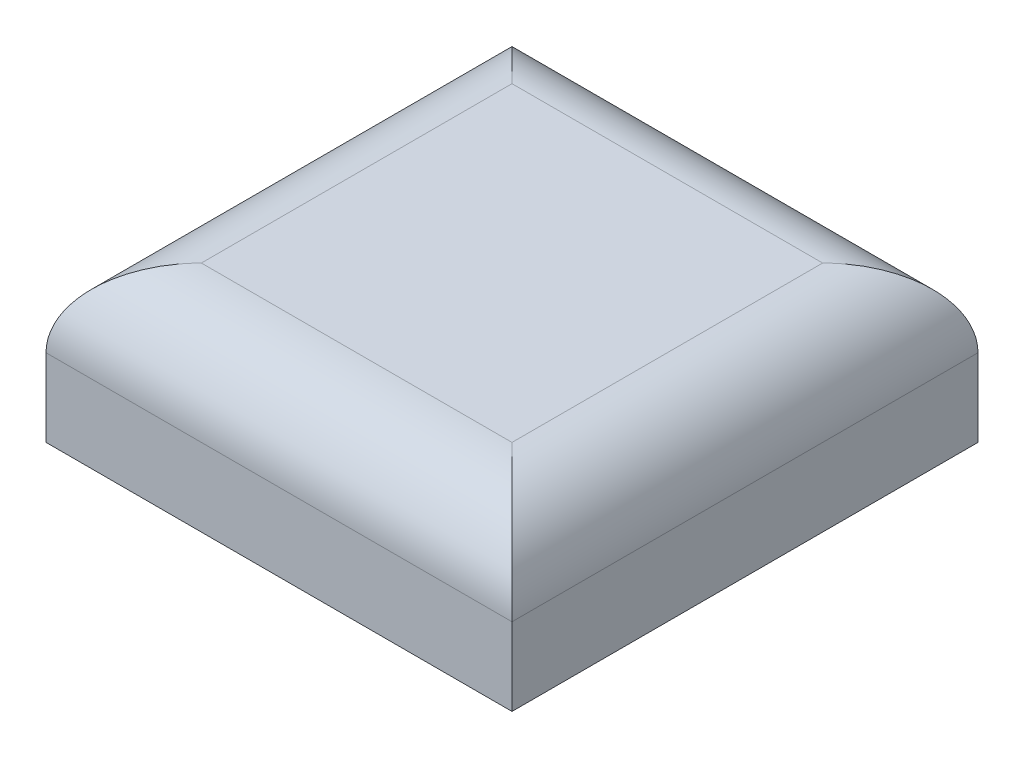
ISO-10303-21;
HEADER;
FILE_DESCRIPTION(('STEP AP214'),'2;1');
FILE_NAME('part.step','',(''),(''),'','','');
FILE_SCHEMA(('AUTOMOTIVE_DESIGN { 1 0 10303 214 1 1 1 1 }'));
ENDSEC;
DATA;
#1=APPLICATION_CONTEXT('core data for automotive mechanical design processes');
#2=APPLICATION_PROTOCOL_DEFINITION('international standard','automotive_design',2000,#1);
#3=PRODUCT_CONTEXT('',#1,'mechanical');
#4=PRODUCT('Part','Part','',(#3));
#5=PRODUCT_RELATED_PRODUCT_CATEGORY('part','',(#4));
#6=PRODUCT_DEFINITION_FORMATION('','',#4);
#7=PRODUCT_DEFINITION_CONTEXT('part definition',#1,'design');
#8=PRODUCT_DEFINITION('design','',#6,#7);
#9=PRODUCT_DEFINITION_SHAPE('','',#8);
#10=(LENGTH_UNIT() NAMED_UNIT(*) SI_UNIT(.MILLI.,.METRE.));
#11=(NAMED_UNIT(*) PLANE_ANGLE_UNIT() SI_UNIT($,.RADIAN.));
#12=(NAMED_UNIT(*) SI_UNIT($,.STERADIAN.) SOLID_ANGLE_UNIT());
#13=UNCERTAINTY_MEASURE_WITH_UNIT(LENGTH_MEASURE(1.E-05),#10,'distance_accuracy_value','');
#14=(GEOMETRIC_REPRESENTATION_CONTEXT(3) GLOBAL_UNCERTAINTY_ASSIGNED_CONTEXT((#13)) GLOBAL_UNIT_ASSIGNED_CONTEXT((#10,
#11,#12)) REPRESENTATION_CONTEXT('',''));
#15=CARTESIAN_POINT('',(0.,0.,0.));
#16=DIRECTION('',(0.,0.,1.));
#17=DIRECTION('',(1.,0.,0.));
#18=AXIS2_PLACEMENT_3D('',#15,#16,#17);
#19=CARTESIAN_POINT('',(-3.02307692307692,4.,-8.33076923076923));
#20=DIRECTION('',(-1.,0.,0.));
#21=DIRECTION('',(0.,0.,1.));
#22=AXIS2_PLACEMENT_3D('',#19,#20,#21);
#23=PLANE('',#22);
#24=DIRECTION('',(0.,-1.,0.));
#25=VECTOR('',#24,1.);
#26=CARTESIAN_POINT('',(-3.02307692307692,4.,-8.33076923076923));
#27=LINE('',#26,#25);
#28=CARTESIAN_POINT('',(-3.02307692307692,2.,-8.33076923076923));
#29=VERTEX_POINT('',#28);
#30=CARTESIAN_POINT('',(-3.02307692307692,0.,-8.33076923076923));
#31=VERTEX_POINT('',#30);
#32=EDGE_CURVE('E94',#29,#31,#27,.T.);
#33=ORIENTED_EDGE('',*,*,#32,.F.);
#34=DIRECTION('',(0.,0.,-1.));
#35=VECTOR('',#34,1.);
#36=CARTESIAN_POINT('',(-3.02307692307692,2.,3.66923076923077));
#37=LINE('',#36,#35);
#38=CARTESIAN_POINT('',(-3.02307692307692,2.,3.66923076923077));
#39=VERTEX_POINT('',#38);
#40=EDGE_CURVE('E64',#29,#39,#37,.F.);
#41=ORIENTED_EDGE('',*,*,#40,.T.);
#42=DIRECTION('',(0.,-1.,0.));
#43=VECTOR('',#42,1.);
#44=CARTESIAN_POINT('',(-3.02307692307692,4.,3.66923076923077));
#45=LINE('',#44,#43);
#46=CARTESIAN_POINT('',(-3.02307692307692,0.,3.66923076923077));
#47=VERTEX_POINT('',#46);
#48=EDGE_CURVE('E116',#39,#47,#45,.T.);
#49=ORIENTED_EDGE('',*,*,#48,.T.);
#50=DIRECTION('',(0.,0.,-1.));
#51=VECTOR('',#50,1.);
#52=CARTESIAN_POINT('',(-3.02307692307692,0.,-8.33076923076923));
#53=LINE('',#52,#51);
#54=EDGE_CURVE('E111',#47,#31,#53,.T.);
#55=ORIENTED_EDGE('',*,*,#54,.T.);
#56=EDGE_LOOP('',(#33,#41,#49,#55));
#57=FACE_BOUND('',#56,.T.);
#58=ADVANCED_FACE('F39',(#57),#23,.F.);
#59=CARTESIAN_POINT('',(-15.0230769230769,4.,-8.33076923076923));
#60=DIRECTION('',(0.,0.,1.));
#61=DIRECTION('',(1.,0.,0.));
#62=AXIS2_PLACEMENT_3D('',#59,#60,#61);
#63=PLANE('',#62);
#64=DIRECTION('',(0.,-1.,0.));
#65=VECTOR('',#64,1.);
#66=CARTESIAN_POINT('',(-15.0230769230769,4.,-8.33076923076923));
#67=LINE('',#66,#65);
#68=CARTESIAN_POINT('',(-15.0230769230769,2.,-8.33076923076923));
#69=VERTEX_POINT('',#68);
#70=CARTESIAN_POINT('',(-15.0230769230769,0.,-8.33076923076923));
#71=VERTEX_POINT('',#70);
#72=EDGE_CURVE('E105',#69,#71,#67,.T.);
#73=ORIENTED_EDGE('',*,*,#72,.F.);
#74=DIRECTION('',(-1.,0.,0.));
#75=VECTOR('',#74,1.);
#76=CARTESIAN_POINT('',(-3.02307692307692,2.,-8.33076923076923));
#77=LINE('',#76,#75);
#78=EDGE_CURVE('E101',#69,#29,#77,.F.);
#79=ORIENTED_EDGE('',*,*,#78,.T.);
#80=ORIENTED_EDGE('',*,*,#32,.T.);
#81=DIRECTION('',(-1.,0.,0.));
#82=VECTOR('',#81,1.);
#83=CARTESIAN_POINT('',(-15.0230769230769,0.,-8.33076923076923));
#84=LINE('',#83,#82);
#85=EDGE_CURVE('E98',#31,#71,#84,.T.);
#86=ORIENTED_EDGE('',*,*,#85,.T.);
#87=EDGE_LOOP('',(#73,#79,#80,#86));
#88=FACE_BOUND('',#87,.T.);
#89=ADVANCED_FACE('F97',(#88),#63,.F.);
#90=CARTESIAN_POINT('',(-15.0230769230769,4.,-8.33076923076923));
#91=DIRECTION('',(1.,0.,0.));
#92=DIRECTION('',(0.,0.,-1.));
#93=AXIS2_PLACEMENT_3D('',#90,#91,#92);
#94=PLANE('',#93);
#95=DIRECTION('',(0.,-1.,0.));
#96=VECTOR('',#95,1.);
#97=CARTESIAN_POINT('',(-15.0230769230769,4.,3.66923076923077));
#98=LINE('',#97,#96);
#99=CARTESIAN_POINT('',(-15.0230769230769,2.,3.66923076923077));
#100=VERTEX_POINT('',#99);
#101=CARTESIAN_POINT('',(-15.0230769230769,0.,3.66923076923077));
#102=VERTEX_POINT('',#101);
#103=EDGE_CURVE('E134',#100,#102,#98,.T.);
#104=ORIENTED_EDGE('',*,*,#103,.F.);
#105=DIRECTION('',(0.,0.,1.));
#106=VECTOR('',#105,1.);
#107=CARTESIAN_POINT('',(-15.0230769230769,2.,-8.33076923076923));
#108=LINE('',#107,#106);
#109=EDGE_CURVE('E11',#100,#69,#108,.F.);
#110=ORIENTED_EDGE('',*,*,#109,.T.);
#111=ORIENTED_EDGE('',*,*,#72,.T.);
#112=DIRECTION('',(0.,0.,1.));
#113=VECTOR('',#112,1.);
#114=CARTESIAN_POINT('',(-15.0230769230769,0.,-8.33076923076923));
#115=LINE('',#114,#113);
#116=EDGE_CURVE('E113',#71,#102,#115,.T.);
#117=ORIENTED_EDGE('',*,*,#116,.T.);
#118=EDGE_LOOP('',(#104,#110,#111,#117));
#119=FACE_BOUND('',#118,.T.);
#120=ADVANCED_FACE('F199',(#119),#94,.F.);
#121=CARTESIAN_POINT('',(-15.0230769230769,4.,3.66923076923077));
#122=DIRECTION('',(0.,0.,-1.));
#123=DIRECTION('',(-1.,0.,0.));
#124=AXIS2_PLACEMENT_3D('',#121,#122,#123);
#125=PLANE('',#124);
#126=ORIENTED_EDGE('',*,*,#48,.F.);
#127=DIRECTION('',(1.,0.,0.));
#128=VECTOR('',#127,1.);
#129=CARTESIAN_POINT('',(-15.0230769230769,2.,3.66923076923077));
#130=LINE('',#129,#128);
#131=EDGE_CURVE('E49',#39,#100,#130,.F.);
#132=ORIENTED_EDGE('',*,*,#131,.T.);
#133=ORIENTED_EDGE('',*,*,#103,.T.);
#134=DIRECTION('',(1.,0.,0.));
#135=VECTOR('',#134,1.);
#136=CARTESIAN_POINT('',(-15.0230769230769,0.,3.66923076923077));
#137=LINE('',#136,#135);
#138=EDGE_CURVE('E129',#102,#47,#137,.T.);
#139=ORIENTED_EDGE('',*,*,#138,.T.);
#140=EDGE_LOOP('',(#126,#132,#133,#139));
#141=FACE_BOUND('',#140,.T.);
#142=ADVANCED_FACE('F190',(#141),#125,.F.);
#143=CARTESIAN_POINT('',(0.,4.,0.));
#144=DIRECTION('',(0.,1.,0.));
#145=DIRECTION('',(0.,0.,1.));
#146=AXIS2_PLACEMENT_3D('',#143,#144,#145);
#147=PLANE('',#146);
#148=DIRECTION('',(0.,0.,-1.));
#149=VECTOR('',#148,1.);
#150=CARTESIAN_POINT('',(-5.02307692307692,4.,-8.33076923076923));
#151=LINE('',#150,#149);
#152=CARTESIAN_POINT('',(-5.02307692307692,4.,1.66923076923077));
#153=VERTEX_POINT('',#152);
#154=CARTESIAN_POINT('',(-5.02307692307692,4.,-6.33076923076923));
#155=VERTEX_POINT('',#154);
#156=EDGE_CURVE('E144',#153,#155,#151,.T.);
#157=ORIENTED_EDGE('',*,*,#156,.T.);
#158=DIRECTION('',(-1.,0.,0.));
#159=VECTOR('',#158,1.);
#160=CARTESIAN_POINT('',(-15.0230769230769,4.,-6.33076923076923));
#161=LINE('',#160,#159);
#162=CARTESIAN_POINT('',(-13.0230769230769,4.,-6.33076923076923));
#163=VERTEX_POINT('',#162);
#164=EDGE_CURVE('E147',#155,#163,#161,.T.);
#165=ORIENTED_EDGE('',*,*,#164,.T.);
#166=DIRECTION('',(0.,0.,1.));
#167=VECTOR('',#166,1.);
#168=CARTESIAN_POINT('',(-13.0230769230769,4.,3.66923076923077));
#169=LINE('',#168,#167);
#170=CARTESIAN_POINT('',(-13.0230769230769,4.,1.66923076923077));
#171=VERTEX_POINT('',#170);
#172=EDGE_CURVE('E104',#163,#171,#169,.T.);
#173=ORIENTED_EDGE('',*,*,#172,.T.);
#174=DIRECTION('',(1.,0.,0.));
#175=VECTOR('',#174,1.);
#176=CARTESIAN_POINT('',(-3.02307692307692,4.,1.66923076923077));
#177=LINE('',#176,#175);
#178=EDGE_CURVE('E141',#171,#153,#177,.T.);
#179=ORIENTED_EDGE('',*,*,#178,.T.);
#180=EDGE_LOOP('',(#157,#165,#173,#179));
#181=FACE_BOUND('',#180,.T.);
#182=ADVANCED_FACE('F181',(#181),#147,.T.);
#183=CARTESIAN_POINT('',(0.,0.,0.));
#184=DIRECTION('',(0.,1.,0.));
#185=DIRECTION('',(0.,0.,1.));
#186=AXIS2_PLACEMENT_3D('',#183,#184,#185);
#187=PLANE('',#186);
#188=CARTESIAN_POINT('',(-9.02307692307692,0.,-2.33076923076923));
#189=DIRECTION('',(0.,-1.,0.));
#190=DIRECTION('',(0.,0.,-1.));
#191=AXIS2_PLACEMENT_3D('',#188,#189,#190);
#192=CIRCLE('',#191,2.);
#193=CARTESIAN_POINT('',(-9.02307692307692,0.,-4.33076923076923));
#194=VERTEX_POINT('',#193);
#195=EDGE_CURVE('E123',#194,#194,#192,.T.);
#196=ORIENTED_EDGE('',*,*,#195,.F.);
#197=EDGE_LOOP('',(#196));
#198=FACE_BOUND('',#197,.T.);
#199=ORIENTED_EDGE('',*,*,#54,.F.);
#200=ORIENTED_EDGE('',*,*,#138,.F.);
#201=ORIENTED_EDGE('',*,*,#116,.F.);
#202=ORIENTED_EDGE('',*,*,#85,.F.);
#203=EDGE_LOOP('',(#199,#200,#201,#202));
#204=FACE_BOUND('',#203,.T.);
#205=ADVANCED_FACE('F109',(#198,#204),#187,.F.);
#206=CARTESIAN_POINT('',(-9.02307692307692,2.,-2.33076923076923));
#207=DIRECTION('',(0.,-1.,0.));
#208=DIRECTION('',(0.,0.,-1.));
#209=AXIS2_PLACEMENT_3D('',#206,#207,#208);
#210=CYLINDRICAL_SURFACE('',#209,2.);
#211=CARTESIAN_POINT('',(-9.02307692307692,2.,-2.33076923076923));
#212=DIRECTION('',(0.,-1.,0.));
#213=DIRECTION('',(0.,0.,-1.));
#214=AXIS2_PLACEMENT_3D('',#211,#212,#213);
#215=CIRCLE('',#214,2.);
#216=CARTESIAN_POINT('',(-9.02307692307692,2.,-4.33076923076923));
#217=VERTEX_POINT('',#216);
#218=EDGE_CURVE('E119',#217,#217,#215,.T.);
#219=ORIENTED_EDGE('',*,*,#218,.F.);
#220=EDGE_LOOP('',(#219));
#221=FACE_BOUND('',#220,.T.);
#222=ORIENTED_EDGE('',*,*,#195,.T.);
#223=EDGE_LOOP('',(#222));
#224=FACE_BOUND('',#223,.T.);
#225=ADVANCED_FACE('F178',(#221,#224),#210,.F.);
#226=CARTESIAN_POINT('',(-9.02307692307692,2.,-2.33076923076923));
#227=DIRECTION('',(0.,-1.,0.));
#228=DIRECTION('',(0.,0.,-1.));
#229=AXIS2_PLACEMENT_3D('',#226,#227,#228);
#230=PLANE('',#229);
#231=ORIENTED_EDGE('',*,*,#218,.T.);
#232=EDGE_LOOP('',(#231));
#233=FACE_BOUND('',#232,.T.);
#234=ADVANCED_FACE('F187',(#233),#230,.T.);
#235=CARTESIAN_POINT('',(0.,2.,1.66923076923077));
#236=DIRECTION('',(-1.,0.,0.));
#237=DIRECTION('',(0.,0.,1.));
#238=AXIS2_PLACEMENT_3D('',#235,#236,#237);
#239=CYLINDRICAL_SURFACE('',#238,2.);
#240=CARTESIAN_POINT('',(-13.0230769230769,2.,1.66923076923077));
#241=DIRECTION('',(-0.707106781186548,0.,-0.707106781186547));
#242=DIRECTION('',(0.707106781186547,0.,-0.707106781186548));
#243=AXIS2_PLACEMENT_3D('',#240,#241,#242);
#244=ELLIPSE('',#243,2.82842712474619,2.);
#245=EDGE_CURVE('E162',#100,#171,#244,.T.);
#246=ORIENTED_EDGE('',*,*,#245,.F.);
#247=ORIENTED_EDGE('',*,*,#131,.F.);
#248=CARTESIAN_POINT('',(-5.02307692307692,2.,1.66923076923077));
#249=DIRECTION('',(-0.707106781186547,0.,0.707106781186548));
#250=DIRECTION('',(-0.707106781186548,0.,-0.707106781186547));
#251=AXIS2_PLACEMENT_3D('',#248,#249,#250);
#252=ELLIPSE('',#251,2.82842712474619,2.);
#253=EDGE_CURVE('E43',#153,#39,#252,.F.);
#254=ORIENTED_EDGE('',*,*,#253,.F.);
#255=ORIENTED_EDGE('',*,*,#178,.F.);
#256=EDGE_LOOP('',(#246,#247,#254,#255));
#257=FACE_BOUND('',#256,.T.);
#258=ADVANCED_FACE('F41',(#257),#239,.T.);
#259=CARTESIAN_POINT('',(-5.02307692307692,2.,0.));
#260=DIRECTION('',(0.,0.,1.));
#261=DIRECTION('',(1.,0.,0.));
#262=AXIS2_PLACEMENT_3D('',#259,#260,#261);
#263=CYLINDRICAL_SURFACE('',#262,2.);
#264=ORIENTED_EDGE('',*,*,#253,.T.);
#265=ORIENTED_EDGE('',*,*,#40,.F.);
#266=CARTESIAN_POINT('',(-5.02307692307692,2.,-6.33076923076923));
#267=DIRECTION('',(0.707106781186548,0.,0.707106781186547));
#268=DIRECTION('',(-0.707106781186547,0.,0.707106781186548));
#269=AXIS2_PLACEMENT_3D('',#266,#267,#268);
#270=ELLIPSE('',#269,2.82842712474619,2.);
#271=EDGE_CURVE('E160',#155,#29,#270,.F.);
#272=ORIENTED_EDGE('',*,*,#271,.F.);
#273=ORIENTED_EDGE('',*,*,#156,.F.);
#274=EDGE_LOOP('',(#264,#265,#272,#273));
#275=FACE_BOUND('',#274,.T.);
#276=ADVANCED_FACE('F209',(#275),#263,.T.);
#277=CARTESIAN_POINT('',(-13.0230769230769,2.,0.));
#278=DIRECTION('',(0.,0.,-1.));
#279=DIRECTION('',(-1.,0.,0.));
#280=AXIS2_PLACEMENT_3D('',#277,#278,#279);
#281=CYLINDRICAL_SURFACE('',#280,2.);
#282=ORIENTED_EDGE('',*,*,#245,.T.);
#283=ORIENTED_EDGE('',*,*,#172,.F.);
#284=CARTESIAN_POINT('',(-13.0230769230769,2.,-6.33076923076923));
#285=DIRECTION('',(0.707106781186547,0.,-0.707106781186548));
#286=DIRECTION('',(-0.707106781186548,0.,-0.707106781186547));
#287=AXIS2_PLACEMENT_3D('',#284,#285,#286);
#288=ELLIPSE('',#287,2.82842712474619,2.);
#289=EDGE_CURVE('E157',#69,#163,#288,.T.);
#290=ORIENTED_EDGE('',*,*,#289,.F.);
#291=ORIENTED_EDGE('',*,*,#109,.F.);
#292=EDGE_LOOP('',(#282,#283,#290,#291));
#293=FACE_BOUND('',#292,.T.);
#294=ADVANCED_FACE('F206',(#293),#281,.T.);
#295=CARTESIAN_POINT('',(0.,2.,-6.33076923076923));
#296=DIRECTION('',(1.,0.,0.));
#297=DIRECTION('',(0.,0.,-1.));
#298=AXIS2_PLACEMENT_3D('',#295,#296,#297);
#299=CYLINDRICAL_SURFACE('',#298,2.);
#300=ORIENTED_EDGE('',*,*,#271,.T.);
#301=ORIENTED_EDGE('',*,*,#78,.F.);
#302=ORIENTED_EDGE('',*,*,#289,.T.);
#303=ORIENTED_EDGE('',*,*,#164,.F.);
#304=EDGE_LOOP('',(#300,#301,#302,#303));
#305=FACE_BOUND('',#304,.T.);
#306=ADVANCED_FACE('F203',(#305),#299,.T.);
#307=CLOSED_SHELL('',(#58,#89,#120,#142,#182,#205,#225,#234,#258,#276,#294,#306));
#308=MANIFOLD_SOLID_BREP('B2',#307);
#309=ADVANCED_BREP_SHAPE_REPRESENTATION('',(#18,#308),#14);
#310=SHAPE_DEFINITION_REPRESENTATION(#9,#309);
ENDSEC;
END-ISO-10303-21;
